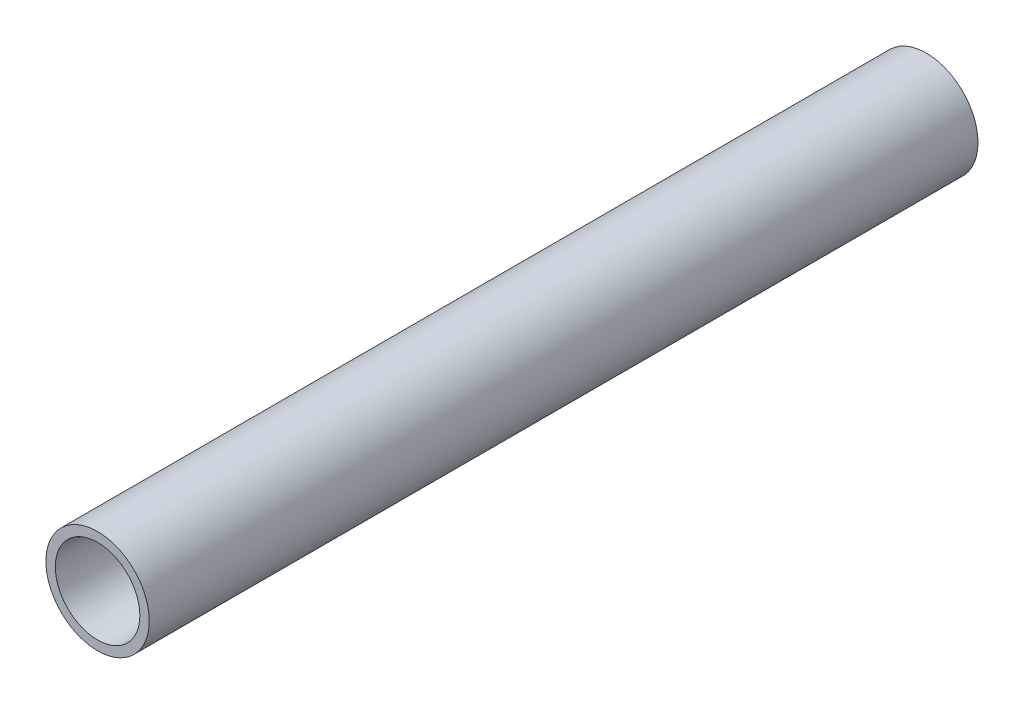
ISO-10303-21;
HEADER;
FILE_DESCRIPTION(('STEP AP214'),'2;1');
FILE_NAME('part.step','',(''),(''),'','','');
FILE_SCHEMA(('AUTOMOTIVE_DESIGN { 1 0 10303 214 1 1 1 1 }'));
ENDSEC;
DATA;
#1=APPLICATION_CONTEXT('core data for automotive mechanical design processes');
#2=APPLICATION_PROTOCOL_DEFINITION('international standard','automotive_design',2000,#1);
#3=PRODUCT_CONTEXT('',#1,'mechanical');
#4=PRODUCT('Part','Part','',(#3));
#5=PRODUCT_RELATED_PRODUCT_CATEGORY('part','',(#4));
#6=PRODUCT_DEFINITION_FORMATION('','',#4);
#7=PRODUCT_DEFINITION_CONTEXT('part definition',#1,'design');
#8=PRODUCT_DEFINITION('design','',#6,#7);
#9=PRODUCT_DEFINITION_SHAPE('','',#8);
#10=(LENGTH_UNIT() NAMED_UNIT(*) SI_UNIT(.MILLI.,.METRE.));
#11=(NAMED_UNIT(*) PLANE_ANGLE_UNIT() SI_UNIT($,.RADIAN.));
#12=(NAMED_UNIT(*) SI_UNIT($,.STERADIAN.) SOLID_ANGLE_UNIT());
#13=UNCERTAINTY_MEASURE_WITH_UNIT(LENGTH_MEASURE(1.E-05),#10,'distance_accuracy_value','');
#14=(GEOMETRIC_REPRESENTATION_CONTEXT(3) GLOBAL_UNCERTAINTY_ASSIGNED_CONTEXT((#13)) GLOBAL_UNIT_ASSIGNED_CONTEXT((#10,
#11,#12)) REPRESENTATION_CONTEXT('',''));
#15=CARTESIAN_POINT('',(0.,0.,0.));
#16=DIRECTION('',(0.,0.,1.));
#17=DIRECTION('',(1.,0.,0.));
#18=AXIS2_PLACEMENT_3D('',#15,#16,#17);
#19=CARTESIAN_POINT('',(0.,0.,44.5));
#20=DIRECTION('',(0.,0.,-1.));
#21=DIRECTION('',(-1.,0.,0.));
#22=AXIS2_PLACEMENT_3D('',#19,#20,#21);
#23=CYLINDRICAL_SURFACE('',#22,1.);
#24=CARTESIAN_POINT('',(0.,0.,5.68));
#25=DIRECTION('',(0.,0.,1.));
#26=DIRECTION('',(1.,0.,0.));
#27=AXIS2_PLACEMENT_3D('',#24,#25,#26);
#28=CIRCLE('',#27,1.);
#29=CARTESIAN_POINT('',(1.,0.,5.68));
#30=VERTEX_POINT('',#29);
#31=EDGE_CURVE('E51',#30,#30,#28,.F.);
#32=ORIENTED_EDGE('',*,*,#31,.T.);
#33=EDGE_LOOP('',(#32));
#34=FACE_BOUND('',#33,.T.);
#35=CARTESIAN_POINT('',(0.,0.,38.82));
#36=DIRECTION('',(0.,0.,1.));
#37=DIRECTION('',(1.,0.,0.));
#38=AXIS2_PLACEMENT_3D('',#35,#36,#37);
#39=CIRCLE('',#38,1.);
#40=CARTESIAN_POINT('',(1.,0.,38.82));
#41=VERTEX_POINT('',#40);
#42=EDGE_CURVE('E38',#41,#41,#39,.T.);
#43=ORIENTED_EDGE('',*,*,#42,.T.);
#44=EDGE_LOOP('',(#43));
#45=FACE_BOUND('',#44,.T.);
#46=ADVANCED_FACE('F34',(#34,#45),#23,.F.);
#47=CARTESIAN_POINT('',(0.,0.,44.5));
#48=DIRECTION('',(0.,0.,-1.));
#49=DIRECTION('',(-1.,0.,0.));
#50=AXIS2_PLACEMENT_3D('',#47,#48,#49);
#51=CYLINDRICAL_SURFACE('',#50,2.775);
#52=CARTESIAN_POINT('',(0.,0.,44.5));
#53=DIRECTION('',(0.,0.,1.));
#54=DIRECTION('',(1.,0.,0.));
#55=AXIS2_PLACEMENT_3D('',#52,#53,#54);
#56=CIRCLE('',#55,2.775);
#57=CARTESIAN_POINT('',(2.775,0.,44.5));
#58=VERTEX_POINT('',#57);
#59=EDGE_CURVE('E10',#58,#58,#56,.T.);
#60=ORIENTED_EDGE('',*,*,#59,.F.);
#61=EDGE_LOOP('',(#60));
#62=FACE_BOUND('',#61,.T.);
#63=CARTESIAN_POINT('',(0.,0.,0.));
#64=DIRECTION('',(0.,0.,1.));
#65=DIRECTION('',(1.,0.,0.));
#66=AXIS2_PLACEMENT_3D('',#63,#64,#65);
#67=CIRCLE('',#66,2.775);
#68=CARTESIAN_POINT('',(2.775,0.,0.));
#69=VERTEX_POINT('',#68);
#70=EDGE_CURVE('E42',#69,#69,#67,.T.);
#71=ORIENTED_EDGE('',*,*,#70,.T.);
#72=EDGE_LOOP('',(#71));
#73=FACE_BOUND('',#72,.T.);
#74=ADVANCED_FACE('F36',(#62,#73),#51,.T.);
#75=CARTESIAN_POINT('',(0.,0.,44.5));
#76=DIRECTION('',(0.,0.,1.));
#77=DIRECTION('',(1.,0.,0.));
#78=AXIS2_PLACEMENT_3D('',#75,#76,#77);
#79=PLANE('',#78);
#80=CARTESIAN_POINT('',(0.,0.,44.5));
#81=DIRECTION('',(0.,0.,1.));
#82=DIRECTION('',(1.,0.,0.));
#83=AXIS2_PLACEMENT_3D('',#80,#81,#82);
#84=CIRCLE('',#83,2.27);
#85=CARTESIAN_POINT('',(2.27,0.,44.5));
#86=VERTEX_POINT('',#85);
#87=EDGE_CURVE('E62',#86,#86,#84,.T.);
#88=ORIENTED_EDGE('',*,*,#87,.F.);
#89=EDGE_LOOP('',(#88));
#90=FACE_BOUND('',#89,.T.);
#91=ORIENTED_EDGE('',*,*,#59,.T.);
#92=EDGE_LOOP('',(#91));
#93=FACE_BOUND('',#92,.T.);
#94=ADVANCED_FACE('F72',(#90,#93),#79,.T.);
#95=CARTESIAN_POINT('',(0.,0.,0.));
#96=DIRECTION('',(0.,0.,1.));
#97=DIRECTION('',(1.,0.,0.));
#98=AXIS2_PLACEMENT_3D('',#95,#96,#97);
#99=PLANE('',#98);
#100=CARTESIAN_POINT('',(0.,0.,0.));
#101=DIRECTION('',(0.,0.,1.));
#102=DIRECTION('',(1.,0.,0.));
#103=AXIS2_PLACEMENT_3D('',#100,#101,#102);
#104=CIRCLE('',#103,2.27);
#105=CARTESIAN_POINT('',(2.27,0.,0.));
#106=VERTEX_POINT('',#105);
#107=EDGE_CURVE('E53',#106,#106,#104,.T.);
#108=ORIENTED_EDGE('',*,*,#107,.T.);
#109=EDGE_LOOP('',(#108));
#110=FACE_BOUND('',#109,.T.);
#111=ORIENTED_EDGE('',*,*,#70,.F.);
#112=EDGE_LOOP('',(#111));
#113=FACE_BOUND('',#112,.T.);
#114=ADVANCED_FACE('F74',(#110,#113),#99,.F.);
#115=CARTESIAN_POINT('',(0.,0.,0.));
#116=DIRECTION('',(0.,0.,-1.));
#117=DIRECTION('',(1.,0.,0.));
#118=AXIS2_PLACEMENT_3D('',#115,#116,#117);
#119=CONICAL_SURFACE('',#118,2.27,0.0536514212063058);
#120=CARTESIAN_POINT('',(0.,0.,5.68));
#121=DIRECTION('',(0.,0.,1.));
#122=DIRECTION('',(1.,0.,0.));
#123=AXIS2_PLACEMENT_3D('',#120,#121,#122);
#124=CIRCLE('',#123,1.9649671949344);
#125=CARTESIAN_POINT('',(1.9649671949344,0.,5.68));
#126=VERTEX_POINT('',#125);
#127=EDGE_CURVE('E47',#126,#126,#124,.T.);
#128=ORIENTED_EDGE('',*,*,#127,.T.);
#129=EDGE_LOOP('',(#128));
#130=FACE_BOUND('',#129,.T.);
#131=ORIENTED_EDGE('',*,*,#107,.F.);
#132=EDGE_LOOP('',(#131));
#133=FACE_BOUND('',#132,.T.);
#134=ADVANCED_FACE('F80',(#130,#133),#119,.F.);
#135=CARTESIAN_POINT('',(0.,0.,5.68));
#136=DIRECTION('',(0.,0.,1.));
#137=DIRECTION('',(1.,0.,0.));
#138=AXIS2_PLACEMENT_3D('',#135,#136,#137);
#139=PLANE('',#138);
#140=ORIENTED_EDGE('',*,*,#31,.F.);
#141=EDGE_LOOP('',(#140));
#142=FACE_BOUND('',#141,.T.);
#143=ORIENTED_EDGE('',*,*,#127,.F.);
#144=EDGE_LOOP('',(#143));
#145=FACE_BOUND('',#144,.T.);
#146=ADVANCED_FACE('F91',(#142,#145),#139,.F.);
#147=CARTESIAN_POINT('',(0.,0.,44.5));
#148=DIRECTION('',(0.,0.,1.));
#149=DIRECTION('',(1.,0.,0.));
#150=AXIS2_PLACEMENT_3D('',#147,#148,#149);
#151=CONICAL_SURFACE('',#150,2.27,0.0536514212063058);
#152=CARTESIAN_POINT('',(0.,0.,38.82));
#153=DIRECTION('',(0.,0.,1.));
#154=DIRECTION('',(1.,0.,0.));
#155=AXIS2_PLACEMENT_3D('',#152,#153,#154);
#156=CIRCLE('',#155,1.9649671949344);
#157=CARTESIAN_POINT('',(1.9649671949344,0.,38.82));
#158=VERTEX_POINT('',#157);
#159=EDGE_CURVE('E58',#158,#158,#156,.T.);
#160=ORIENTED_EDGE('',*,*,#159,.F.);
#161=EDGE_LOOP('',(#160));
#162=FACE_BOUND('',#161,.T.);
#163=ORIENTED_EDGE('',*,*,#87,.T.);
#164=EDGE_LOOP('',(#163));
#165=FACE_BOUND('',#164,.T.);
#166=ADVANCED_FACE('F70',(#162,#165),#151,.F.);
#167=CARTESIAN_POINT('',(0.,0.,38.82));
#168=DIRECTION('',(0.,0.,1.));
#169=DIRECTION('',(1.,0.,0.));
#170=AXIS2_PLACEMENT_3D('',#167,#168,#169);
#171=PLANE('',#170);
#172=ORIENTED_EDGE('',*,*,#42,.F.);
#173=EDGE_LOOP('',(#172));
#174=FACE_BOUND('',#173,.T.);
#175=ORIENTED_EDGE('',*,*,#159,.T.);
#176=EDGE_LOOP('',(#175));
#177=FACE_BOUND('',#176,.T.);
#178=ADVANCED_FACE('F118',(#174,#177),#171,.T.);
#179=CLOSED_SHELL('',(#46,#74,#94,#114,#134,#146,#166,#178));
#180=MANIFOLD_SOLID_BREP('B2',#179);
#181=ADVANCED_BREP_SHAPE_REPRESENTATION('',(#18,#180),#14);
#182=SHAPE_DEFINITION_REPRESENTATION(#9,#181);
ENDSEC;
END-ISO-10303-21;
